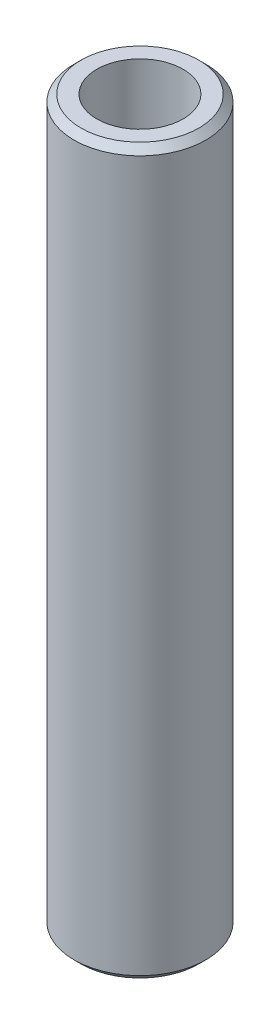
ISO-10303-21;
HEADER;
FILE_DESCRIPTION(('STEP AP214'),'2;1');
FILE_NAME('part.step','',(''),(''),'','','');
FILE_SCHEMA(('AUTOMOTIVE_DESIGN { 1 0 10303 214 1 1 1 1 }'));
ENDSEC;
DATA;
#1=APPLICATION_CONTEXT('core data for automotive mechanical design processes');
#2=APPLICATION_PROTOCOL_DEFINITION('international standard','automotive_design',2000,#1);
#3=PRODUCT_CONTEXT('',#1,'mechanical');
#4=PRODUCT('Part','Part','',(#3));
#5=PRODUCT_RELATED_PRODUCT_CATEGORY('part','',(#4));
#6=PRODUCT_DEFINITION_FORMATION('','',#4);
#7=PRODUCT_DEFINITION_CONTEXT('part definition',#1,'design');
#8=PRODUCT_DEFINITION('design','',#6,#7);
#9=PRODUCT_DEFINITION_SHAPE('','',#8);
#10=(LENGTH_UNIT() NAMED_UNIT(*) SI_UNIT(.MILLI.,.METRE.));
#11=(NAMED_UNIT(*) PLANE_ANGLE_UNIT() SI_UNIT($,.RADIAN.));
#12=(NAMED_UNIT(*) SI_UNIT($,.STERADIAN.) SOLID_ANGLE_UNIT());
#13=UNCERTAINTY_MEASURE_WITH_UNIT(LENGTH_MEASURE(1.E-05),#10,'distance_accuracy_value','');
#14=(GEOMETRIC_REPRESENTATION_CONTEXT(3) GLOBAL_UNCERTAINTY_ASSIGNED_CONTEXT((#13)) GLOBAL_UNIT_ASSIGNED_CONTEXT((#10,
#11,#12)) REPRESENTATION_CONTEXT('',''));
#15=CARTESIAN_POINT('',(0.,0.,0.));
#16=DIRECTION('',(0.,0.,1.));
#17=DIRECTION('',(1.,0.,0.));
#18=AXIS2_PLACEMENT_3D('',#15,#16,#17);
#19=CARTESIAN_POINT('',(0.,137.390276624987,0.));
#20=DIRECTION('',(0.,-1.,0.));
#21=DIRECTION('',(0.,0.,-1.));
#22=AXIS2_PLACEMENT_3D('',#19,#20,#21);
#23=CYLINDRICAL_SURFACE('',#22,12.5);
#24=CARTESIAN_POINT('',(0.,136.070215655983,0.));
#25=DIRECTION('',(0.,1.,0.));
#26=DIRECTION('',(0.,0.,1.));
#27=AXIS2_PLACEMENT_3D('',#24,#25,#26);
#28=CIRCLE('',#27,12.5);
#29=CARTESIAN_POINT('',(0.,136.070215655983,12.5));
#30=VERTEX_POINT('',#29);
#31=EDGE_CURVE('E50',#30,#30,#28,.F.);
#32=ORIENTED_EDGE('',*,*,#31,.T.);
#33=EDGE_LOOP('',(#32));
#34=FACE_BOUND('',#33,.T.);
#35=CARTESIAN_POINT('',(0.,1.32006096900447,0.));
#36=DIRECTION('',(0.,1.,0.));
#37=DIRECTION('',(0.,0.,1.));
#38=AXIS2_PLACEMENT_3D('',#35,#36,#37);
#39=CIRCLE('',#38,12.5);
#40=CARTESIAN_POINT('',(0.,1.32006096900447,12.5));
#41=VERTEX_POINT('',#40);
#42=EDGE_CURVE('E51',#41,#41,#39,.T.);
#43=ORIENTED_EDGE('',*,*,#42,.T.);
#44=EDGE_LOOP('',(#43));
#45=FACE_BOUND('',#44,.T.);
#46=ADVANCED_FACE('F39',(#34,#45),#23,.T.);
#47=CARTESIAN_POINT('',(0.,137.390276624987,0.));
#48=DIRECTION('',(0.,1.,0.));
#49=DIRECTION('',(0.,0.,1.));
#50=AXIS2_PLACEMENT_3D('',#47,#48,#49);
#51=PLANE('',#50);
#52=CARTESIAN_POINT('',(0.,137.390276624987,0.));
#53=DIRECTION('',(0.,1.,0.));
#54=DIRECTION('',(0.,0.,1.));
#55=AXIS2_PLACEMENT_3D('',#52,#53,#54);
#56=CIRCLE('',#55,11.1799390309955);
#57=CARTESIAN_POINT('',(0.,137.390276624987,11.1799390309955));
#58=VERTEX_POINT('',#57);
#59=EDGE_CURVE('E54',#58,#58,#56,.T.);
#60=ORIENTED_EDGE('',*,*,#59,.T.);
#61=EDGE_LOOP('',(#60));
#62=FACE_BOUND('',#61,.T.);
#63=CARTESIAN_POINT('',(0.,137.390276624987,0.));
#64=DIRECTION('',(0.,1.,0.));
#65=DIRECTION('',(0.,0.,1.));
#66=AXIS2_PLACEMENT_3D('',#63,#64,#65);
#67=CIRCLE('',#66,8.18585719256491);
#68=CARTESIAN_POINT('',(0.,137.390276624987,8.18585719256491));
#69=VERTEX_POINT('',#68);
#70=EDGE_CURVE('E58',#69,#69,#67,.T.);
#71=ORIENTED_EDGE('',*,*,#70,.F.);
#72=EDGE_LOOP('',(#71));
#73=FACE_BOUND('',#72,.T.);
#74=ADVANCED_FACE('F69',(#62,#73),#51,.T.);
#75=CARTESIAN_POINT('',(0.,0.,0.));
#76=DIRECTION('',(0.,1.,0.));
#77=DIRECTION('',(0.,0.,1.));
#78=AXIS2_PLACEMENT_3D('',#75,#76,#77);
#79=PLANE('',#78);
#80=CARTESIAN_POINT('',(0.,0.,0.));
#81=DIRECTION('',(0.,1.,0.));
#82=DIRECTION('',(0.,0.,1.));
#83=AXIS2_PLACEMENT_3D('',#80,#81,#82);
#84=CIRCLE('',#83,11.1799390309955);
#85=CARTESIAN_POINT('',(0.,0.,11.1799390309955));
#86=VERTEX_POINT('',#85);
#87=EDGE_CURVE('E10',#86,#86,#84,.F.);
#88=ORIENTED_EDGE('',*,*,#87,.T.);
#89=EDGE_LOOP('',(#88));
#90=FACE_BOUND('',#89,.T.);
#91=CARTESIAN_POINT('',(0.,0.,0.));
#92=DIRECTION('',(0.,1.,0.));
#93=DIRECTION('',(0.,0.,1.));
#94=AXIS2_PLACEMENT_3D('',#91,#92,#93);
#95=CIRCLE('',#94,8.18585719256491);
#96=CARTESIAN_POINT('',(0.,0.,8.18585719256491));
#97=VERTEX_POINT('',#96);
#98=EDGE_CURVE('E63',#97,#97,#95,.T.);
#99=ORIENTED_EDGE('',*,*,#98,.T.);
#100=EDGE_LOOP('',(#99));
#101=FACE_BOUND('',#100,.T.);
#102=ADVANCED_FACE('F75',(#90,#101),#79,.F.);
#103=CARTESIAN_POINT('',(0.,137.390276624987,0.));
#104=DIRECTION('',(0.,-1.,0.));
#105=DIRECTION('',(0.,0.,-1.));
#106=AXIS2_PLACEMENT_3D('',#103,#104,#105);
#107=CYLINDRICAL_SURFACE('',#106,8.18585719256491);
#108=ORIENTED_EDGE('',*,*,#70,.T.);
#109=EDGE_LOOP('',(#108));
#110=FACE_BOUND('',#109,.T.);
#111=ORIENTED_EDGE('',*,*,#98,.F.);
#112=EDGE_LOOP('',(#111));
#113=FACE_BOUND('',#112,.T.);
#114=ADVANCED_FACE('F70',(#110,#113),#107,.F.);
#115=CARTESIAN_POINT('',(0.,137.390276624987,0.));
#116=DIRECTION('',(0.,-1.,0.));
#117=DIRECTION('',(0.,0.,-1.));
#118=AXIS2_PLACEMENT_3D('',#115,#116,#117);
#119=CONICAL_SURFACE('',#118,11.1799390309955,0.78539816339745);
#120=ORIENTED_EDGE('',*,*,#31,.F.);
#121=EDGE_LOOP('',(#120));
#122=FACE_BOUND('',#121,.T.);
#123=ORIENTED_EDGE('',*,*,#59,.F.);
#124=EDGE_LOOP('',(#123));
#125=FACE_BOUND('',#124,.T.);
#126=ADVANCED_FACE('F81',(#122,#125),#119,.T.);
#127=CARTESIAN_POINT('',(0.,1.32006096900447,0.));
#128=DIRECTION('',(0.,1.,0.));
#129=DIRECTION('',(0.,0.,1.));
#130=AXIS2_PLACEMENT_3D('',#127,#128,#129);
#131=CONICAL_SURFACE('',#130,12.5,0.785398163397454);
#132=ORIENTED_EDGE('',*,*,#87,.F.);
#133=EDGE_LOOP('',(#132));
#134=FACE_BOUND('',#133,.T.);
#135=ORIENTED_EDGE('',*,*,#42,.F.);
#136=EDGE_LOOP('',(#135));
#137=FACE_BOUND('',#136,.T.);
#138=ADVANCED_FACE('F45',(#134,#137),#131,.T.);
#139=CLOSED_SHELL('',(#46,#74,#102,#114,#126,#138));
#140=MANIFOLD_SOLID_BREP('B2',#139);
#141=ADVANCED_BREP_SHAPE_REPRESENTATION('',(#18,#140),#14);
#142=SHAPE_DEFINITION_REPRESENTATION(#9,#141);
ENDSEC;
END-ISO-10303-21;
